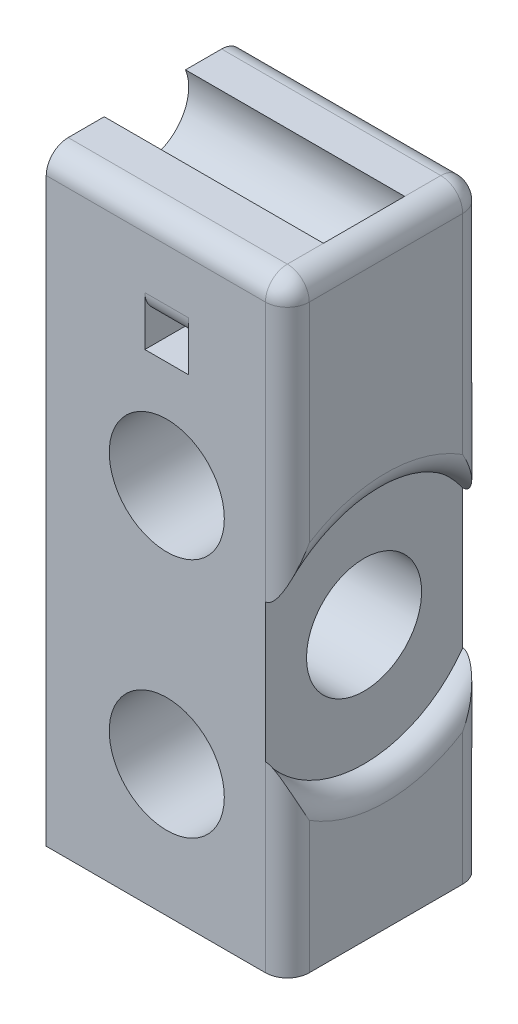
ISO-10303-21;
HEADER;
FILE_DESCRIPTION(('STEP AP214'),'2;1');
FILE_NAME('part.step','',(''),(''),'','','');
FILE_SCHEMA(('AUTOMOTIVE_DESIGN { 1 0 10303 214 1 1 1 1 }'));
ENDSEC;
DATA;
#1=APPLICATION_CONTEXT('core data for automotive mechanical design processes');
#2=APPLICATION_PROTOCOL_DEFINITION('international standard','automotive_design',2000,#1);
#3=PRODUCT_CONTEXT('',#1,'mechanical');
#4=PRODUCT('Part','Part','',(#3));
#5=PRODUCT_RELATED_PRODUCT_CATEGORY('part','',(#4));
#6=PRODUCT_DEFINITION_FORMATION('','',#4);
#7=PRODUCT_DEFINITION_CONTEXT('part definition',#1,'design');
#8=PRODUCT_DEFINITION('design','',#6,#7);
#9=PRODUCT_DEFINITION_SHAPE('','',#8);
#10=(LENGTH_UNIT() NAMED_UNIT(*) SI_UNIT(.MILLI.,.METRE.));
#11=(NAMED_UNIT(*) PLANE_ANGLE_UNIT() SI_UNIT($,.RADIAN.));
#12=(NAMED_UNIT(*) SI_UNIT($,.STERADIAN.) SOLID_ANGLE_UNIT());
#13=UNCERTAINTY_MEASURE_WITH_UNIT(LENGTH_MEASURE(1.E-05),#10,'distance_accuracy_value','');
#14=(GEOMETRIC_REPRESENTATION_CONTEXT(3) GLOBAL_UNCERTAINTY_ASSIGNED_CONTEXT((#13)) GLOBAL_UNIT_ASSIGNED_CONTEXT((#10,
#11,#12)) REPRESENTATION_CONTEXT('',''));
#15=CARTESIAN_POINT('',(0.,0.,0.));
#16=DIRECTION('',(0.,0.,1.));
#17=DIRECTION('',(1.,0.,0.));
#18=AXIS2_PLACEMENT_3D('',#15,#16,#17);
#19=CARTESIAN_POINT('',(0.,55.,-18.));
#20=DIRECTION('',(0.,1.,0.));
#21=DIRECTION('',(0.,0.,1.));
#22=AXIS2_PLACEMENT_3D('',#19,#20,#21);
#23=PLANE('',#22);
#24=DIRECTION('',(-1.,0.,0.));
#25=VECTOR('',#24,1.);
#26=CARTESIAN_POINT('',(22.,55.,-2.));
#27=LINE('',#26,#25);
#28=CARTESIAN_POINT('',(0.,55.,-2.));
#29=VERTEX_POINT('',#28);
#30=CARTESIAN_POINT('',(20.,55.,-2.));
#31=VERTEX_POINT('',#30);
#32=EDGE_CURVE('E189',#29,#31,#27,.F.);
#33=ORIENTED_EDGE('',*,*,#32,.T.);
#34=DIRECTION('',(0.,0.,1.));
#35=VECTOR('',#34,1.);
#36=CARTESIAN_POINT('',(20.,55.,-18.));
#37=LINE('',#36,#35);
#38=CARTESIAN_POINT('',(20.,55.,-5.29190075645216));
#39=VERTEX_POINT('',#38);
#40=EDGE_CURVE('E11',#31,#39,#37,.F.);
#41=ORIENTED_EDGE('',*,*,#40,.T.);
#42=DIRECTION('',(-1.,0.,0.));
#43=VECTOR('',#42,1.);
#44=CARTESIAN_POINT('',(20.,55.,-5.29190075645216));
#45=LINE('',#44,#43);
#46=CARTESIAN_POINT('',(0.,55.,-5.29190075645216));
#47=VERTEX_POINT('',#46);
#48=EDGE_CURVE('E290',#39,#47,#45,.T.);
#49=ORIENTED_EDGE('',*,*,#48,.T.);
#50=DIRECTION('',(0.,0.,1.));
#51=VECTOR('',#50,1.);
#52=CARTESIAN_POINT('',(0.,55.,-18.));
#53=LINE('',#52,#51);
#54=EDGE_CURVE('E286',#47,#29,#53,.T.);
#55=ORIENTED_EDGE('',*,*,#54,.T.);
#56=EDGE_LOOP('',(#33,#41,#49,#55));
#57=FACE_BOUND('',#56,.T.);
#58=ADVANCED_FACE('F37',(#57),#23,.T.);
#59=CARTESIAN_POINT('',(22.,55.,-18.));
#60=DIRECTION('',(1.,0.,0.));
#61=DIRECTION('',(0.,1.,0.));
#62=AXIS2_PLACEMENT_3D('',#59,#60,#61);
#63=PLANE('',#62);
#64=DIRECTION('',(0.,0.,1.));
#65=VECTOR('',#64,1.);
#66=CARTESIAN_POINT('',(22.,0.,-18.));
#67=LINE('',#66,#65);
#68=CARTESIAN_POINT('',(22.,0.,-16.));
#69=VERTEX_POINT('',#68);
#70=CARTESIAN_POINT('',(22.,0.,-2.));
#71=VERTEX_POINT('',#70);
#72=EDGE_CURVE('E277',#69,#71,#67,.T.);
#73=ORIENTED_EDGE('',*,*,#72,.F.);
#74=DIRECTION('',(0.,1.,0.));
#75=VECTOR('',#74,1.);
#76=CARTESIAN_POINT('',(22.,55.,-16.));
#77=LINE('',#76,#75);
#78=CARTESIAN_POINT('',(22.,12.0455488498967,-16.));
#79=VERTEX_POINT('',#78);
#80=EDGE_CURVE('E305',#69,#79,#77,.T.);
#81=ORIENTED_EDGE('',*,*,#80,.T.);
#82=CARTESIAN_POINT('',(22.,23.,-9.));
#83=DIRECTION('',(1.,0.,0.));
#84=DIRECTION('',(0.,1.,0.));
#85=AXIS2_PLACEMENT_3D('',#82,#83,#84);
#86=CIRCLE('',#85,13.);
#87=CARTESIAN_POINT('',(22.,12.0455488498967,-2.));
#88=VERTEX_POINT('',#87);
#89=EDGE_CURVE('E303',#79,#88,#86,.F.);
#90=ORIENTED_EDGE('',*,*,#89,.T.);
#91=DIRECTION('',(0.,1.,0.));
#92=VECTOR('',#91,1.);
#93=CARTESIAN_POINT('',(22.,0.,-2.));
#94=LINE('',#93,#92);
#95=EDGE_CURVE('E209',#88,#71,#94,.F.);
#96=ORIENTED_EDGE('',*,*,#95,.T.);
#97=EDGE_LOOP('',(#73,#81,#90,#96));
#98=FACE_BOUND('',#97,.T.);
#99=ADVANCED_FACE('F398',(#98),#63,.T.);
#100=CARTESIAN_POINT('',(22.,23.,-9.));
#101=DIRECTION('',(-1.,0.,0.));
#102=DIRECTION('',(0.,0.,1.));
#103=AXIS2_PLACEMENT_3D('',#100,#101,#102);
#104=CYLINDRICAL_SURFACE('',#103,5.25);
#105=CARTESIAN_POINT('',(0.,23.,-9.));
#106=DIRECTION('',(-1.,0.,0.));
#107=DIRECTION('',(0.,0.,1.));
#108=AXIS2_PLACEMENT_3D('',#105,#106,#107);
#109=CIRCLE('',#108,5.25);
#110=CARTESIAN_POINT('',(0.,23.,-3.75));
#111=VERTEX_POINT('',#110);
#112=EDGE_CURVE('E228',#111,#111,#109,.T.);
#113=ORIENTED_EDGE('',*,*,#112,.T.);
#114=EDGE_LOOP('',(#113));
#115=FACE_BOUND('',#114,.T.);
#116=CARTESIAN_POINT('',(20.,23.,-9.));
#117=DIRECTION('',(1.,0.,0.));
#118=DIRECTION('',(0.,1.,0.));
#119=AXIS2_PLACEMENT_3D('',#116,#117,#118);
#120=CIRCLE('',#119,5.25);
#121=CARTESIAN_POINT('',(20.,28.25,-9.));
#122=VERTEX_POINT('',#121);
#123=EDGE_CURVE('E203',#122,#122,#120,.F.);
#124=ORIENTED_EDGE('',*,*,#123,.F.);
#125=EDGE_LOOP('',(#124));
#126=FACE_BOUND('',#125,.T.);
#127=ADVANCED_FACE('F405',(#115,#126),#104,.F.);
#128=DIRECTION('',(-1.,0.,0.));
#129=VECTOR('',#128,1.);
#130=CARTESIAN_POINT('',(20.,55.,-12.7080992435478));
#131=LINE('',#130,#129);
#132=CARTESIAN_POINT('',(0.,55.,-12.7080992435478));
#133=VERTEX_POINT('',#132);
#134=CARTESIAN_POINT('',(20.,55.,-12.7080992435478));
#135=VERTEX_POINT('',#134);
#136=EDGE_CURVE('E293',#133,#135,#131,.F.);
#137=ORIENTED_EDGE('',*,*,#136,.T.);
#138=DIRECTION('',(0.,0.,1.));
#139=VECTOR('',#138,1.);
#140=CARTESIAN_POINT('',(20.,55.,-18.));
#141=LINE('',#140,#139);
#142=CARTESIAN_POINT('',(20.,55.,-16.));
#143=VERTEX_POINT('',#142);
#144=EDGE_CURVE('E46',#135,#143,#141,.F.);
#145=ORIENTED_EDGE('',*,*,#144,.T.);
#146=DIRECTION('',(-1.,0.,0.));
#147=VECTOR('',#146,1.);
#148=CARTESIAN_POINT('',(0.,55.,-16.));
#149=LINE('',#148,#147);
#150=CARTESIAN_POINT('',(0.,55.,-16.));
#151=VERTEX_POINT('',#150);
#152=EDGE_CURVE('E322',#143,#151,#149,.T.);
#153=ORIENTED_EDGE('',*,*,#152,.T.);
#154=EDGE_CURVE('E284',#151,#133,#53,.T.);
#155=ORIENTED_EDGE('',*,*,#154,.T.);
#156=EDGE_LOOP('',(#137,#145,#153,#155));
#157=FACE_BOUND('',#156,.T.);
#158=ADVANCED_FACE('F401',(#157),#23,.T.);
#159=CARTESIAN_POINT('',(22.,0.,-18.));
#160=DIRECTION('',(0.,-1.,0.));
#161=DIRECTION('',(1.,0.,0.));
#162=AXIS2_PLACEMENT_3D('',#159,#160,#161);
#163=PLANE('',#162);
#164=DIRECTION('',(1.,0.,0.));
#165=VECTOR('',#164,1.);
#166=CARTESIAN_POINT('',(22.,0.,-18.));
#167=LINE('',#166,#165);
#168=CARTESIAN_POINT('',(0.,0.,-18.));
#169=VERTEX_POINT('',#168);
#170=CARTESIAN_POINT('',(20.,0.,-18.));
#171=VERTEX_POINT('',#170);
#172=EDGE_CURVE('E271',#169,#171,#167,.T.);
#173=ORIENTED_EDGE('',*,*,#172,.T.);
#174=CARTESIAN_POINT('',(20.,0.,-16.));
#175=DIRECTION('',(0.,-1.,0.));
#176=DIRECTION('',(1.,0.,0.));
#177=AXIS2_PLACEMENT_3D('',#174,#175,#176);
#178=CIRCLE('',#177,2.);
#179=EDGE_CURVE('E316',#171,#69,#178,.T.);
#180=ORIENTED_EDGE('',*,*,#179,.T.);
#181=ORIENTED_EDGE('',*,*,#72,.T.);
#182=CARTESIAN_POINT('',(20.,0.,-2.));
#183=DIRECTION('',(0.,-1.,0.));
#184=DIRECTION('',(1.,0.,0.));
#185=AXIS2_PLACEMENT_3D('',#182,#183,#184);
#186=CIRCLE('',#185,2.);
#187=CARTESIAN_POINT('',(20.,0.,0.));
#188=VERTEX_POINT('',#187);
#189=EDGE_CURVE('E314',#71,#188,#186,.T.);
#190=ORIENTED_EDGE('',*,*,#189,.T.);
#191=DIRECTION('',(1.,0.,0.));
#192=VECTOR('',#191,1.);
#193=CARTESIAN_POINT('',(22.,0.,0.));
#194=LINE('',#193,#192);
#195=CARTESIAN_POINT('',(0.,0.,0.));
#196=VERTEX_POINT('',#195);
#197=EDGE_CURVE('E185',#196,#188,#194,.T.);
#198=ORIENTED_EDGE('',*,*,#197,.F.);
#199=DIRECTION('',(0.,0.,1.));
#200=VECTOR('',#199,1.);
#201=CARTESIAN_POINT('',(0.,0.,-18.));
#202=LINE('',#201,#200);
#203=EDGE_CURVE('E280',#169,#196,#202,.T.);
#204=ORIENTED_EDGE('',*,*,#203,.F.);
#205=EDGE_LOOP('',(#173,#180,#181,#190,#198,#204));
#206=FACE_BOUND('',#205,.T.);
#207=ADVANCED_FACE('F411',(#206),#163,.T.);
#208=CARTESIAN_POINT('',(0.,0.,-18.));
#209=DIRECTION('',(-1.,0.,0.));
#210=DIRECTION('',(0.,0.,1.));
#211=AXIS2_PLACEMENT_3D('',#208,#209,#210);
#212=PLANE('',#211);
#213=ORIENTED_EDGE('',*,*,#112,.F.);
#214=EDGE_LOOP('',(#213));
#215=FACE_BOUND('',#214,.T.);
#216=ORIENTED_EDGE('',*,*,#154,.F.);
#217=CARTESIAN_POINT('',(0.,53.,-16.));
#218=DIRECTION('',(-1.,0.,0.));
#219=DIRECTION('',(0.,0.,1.));
#220=AXIS2_PLACEMENT_3D('',#217,#218,#219);
#221=CIRCLE('',#220,2.);
#222=CARTESIAN_POINT('',(0.,53.,-18.));
#223=VERTEX_POINT('',#222);
#224=EDGE_CURVE('E326',#151,#223,#221,.T.);
#225=ORIENTED_EDGE('',*,*,#224,.T.);
#226=DIRECTION('',(0.,-1.,0.));
#227=VECTOR('',#226,1.);
#228=CARTESIAN_POINT('',(0.,0.,-18.));
#229=LINE('',#228,#227);
#230=EDGE_CURVE('E274',#223,#169,#229,.T.);
#231=ORIENTED_EDGE('',*,*,#230,.T.);
#232=ORIENTED_EDGE('',*,*,#203,.T.);
#233=DIRECTION('',(0.,-1.,0.));
#234=VECTOR('',#233,1.);
#235=CARTESIAN_POINT('',(0.,0.,0.));
#236=LINE('',#235,#234);
#237=CARTESIAN_POINT('',(0.,53.,0.));
#238=VERTEX_POINT('',#237);
#239=EDGE_CURVE('E275',#238,#196,#236,.T.);
#240=ORIENTED_EDGE('',*,*,#239,.F.);
#241=CARTESIAN_POINT('',(0.,53.,-2.));
#242=DIRECTION('',(-1.,0.,0.));
#243=DIRECTION('',(0.,0.,1.));
#244=AXIS2_PLACEMENT_3D('',#241,#242,#243);
#245=CIRCLE('',#244,2.);
#246=EDGE_CURVE('E324',#238,#29,#245,.T.);
#247=ORIENTED_EDGE('',*,*,#246,.T.);
#248=ORIENTED_EDGE('',*,*,#54,.F.);
#249=CARTESIAN_POINT('',(0.,53.5,-9.));
#250=DIRECTION('',(1.,0.,0.));
#251=DIRECTION('',(0.,0.,-1.));
#252=AXIS2_PLACEMENT_3D('',#249,#250,#251);
#253=CIRCLE('',#252,4.00000000000001);
#254=EDGE_CURVE('E224',#47,#133,#253,.T.);
#255=ORIENTED_EDGE('',*,*,#254,.T.);
#256=EDGE_LOOP('',(#216,#225,#231,#232,#240,#247,#248,#255));
#257=FACE_BOUND('',#256,.T.);
#258=ADVANCED_FACE('F417',(#215,#257),#212,.T.);
#259=DIRECTION('',(0.,1.,0.));
#260=VECTOR('',#259,1.);
#261=CARTESIAN_POINT('',(22.,55.,-16.));
#262=LINE('',#261,#260);
#263=CARTESIAN_POINT('',(22.,33.9544511501033,-16.));
#264=VERTEX_POINT('',#263);
#265=CARTESIAN_POINT('',(22.,53.,-16.));
#266=VERTEX_POINT('',#265);
#267=EDGE_CURVE('E300',#264,#266,#262,.T.);
#268=ORIENTED_EDGE('',*,*,#267,.T.);
#269=DIRECTION('',(0.,0.,1.));
#270=VECTOR('',#269,1.);
#271=CARTESIAN_POINT('',(22.,53.,-18.));
#272=LINE('',#271,#270);
#273=CARTESIAN_POINT('',(22.,53.,-2.));
#274=VERTEX_POINT('',#273);
#275=EDGE_CURVE('E62',#266,#274,#272,.T.);
#276=ORIENTED_EDGE('',*,*,#275,.T.);
#277=DIRECTION('',(0.,1.,0.));
#278=VECTOR('',#277,1.);
#279=CARTESIAN_POINT('',(22.,29.3245553203368,-2.));
#280=LINE('',#279,#278);
#281=CARTESIAN_POINT('',(22.,33.9544511501033,-2.));
#282=VERTEX_POINT('',#281);
#283=EDGE_CURVE('E295',#274,#282,#280,.F.);
#284=ORIENTED_EDGE('',*,*,#283,.T.);
#285=CARTESIAN_POINT('',(22.,23.,-9.));
#286=DIRECTION('',(1.,0.,0.));
#287=DIRECTION('',(0.,1.,0.));
#288=AXIS2_PLACEMENT_3D('',#285,#286,#287);
#289=CIRCLE('',#288,13.);
#290=EDGE_CURVE('E298',#282,#264,#289,.F.);
#291=ORIENTED_EDGE('',*,*,#290,.T.);
#292=EDGE_LOOP('',(#268,#276,#284,#291));
#293=FACE_BOUND('',#292,.T.);
#294=ADVANCED_FACE('F408',(#293),#63,.T.);
#295=CARTESIAN_POINT('',(0.,0.,-18.));
#296=DIRECTION('',(0.,0.,-1.));
#297=DIRECTION('',(-1.,0.,0.));
#298=AXIS2_PLACEMENT_3D('',#295,#296,#297);
#299=PLANE('',#298);
#300=DIRECTION('',(0.,-1.,0.));
#301=VECTOR('',#300,1.);
#302=CARTESIAN_POINT('',(20.,0.,-18.));
#303=LINE('',#302,#301);
#304=CARTESIAN_POINT('',(20.,29.3245553203368,-18.));
#305=VERTEX_POINT('',#304);
#306=CARTESIAN_POINT('',(20.,16.6754446796632,-18.));
#307=VERTEX_POINT('',#306);
#308=EDGE_CURVE('E202',#305,#307,#303,.T.);
#309=ORIENTED_EDGE('',*,*,#308,.T.);
#310=DIRECTION('',(0.,1.,0.));
#311=VECTOR('',#310,1.);
#312=CARTESIAN_POINT('',(20.,0.,-18.));
#313=LINE('',#312,#311);
#314=EDGE_CURVE('E312',#307,#171,#313,.F.);
#315=ORIENTED_EDGE('',*,*,#314,.T.);
#316=ORIENTED_EDGE('',*,*,#172,.F.);
#317=ORIENTED_EDGE('',*,*,#230,.F.);
#318=DIRECTION('',(-1.,0.,0.));
#319=VECTOR('',#318,1.);
#320=CARTESIAN_POINT('',(0.,53.,-18.));
#321=LINE('',#320,#319);
#322=CARTESIAN_POINT('',(20.,53.,-18.));
#323=VERTEX_POINT('',#322);
#324=EDGE_CURVE('E307',#223,#323,#321,.F.);
#325=ORIENTED_EDGE('',*,*,#324,.T.);
#326=DIRECTION('',(0.,1.,0.));
#327=VECTOR('',#326,1.);
#328=CARTESIAN_POINT('',(20.,0.,-18.));
#329=LINE('',#328,#327);
#330=EDGE_CURVE('E310',#323,#305,#329,.F.);
#331=ORIENTED_EDGE('',*,*,#330,.T.);
#332=EDGE_LOOP('',(#309,#315,#316,#317,#325,#331));
#333=FACE_BOUND('',#332,.T.);
#334=DIRECTION('',(-1.,0.,0.));
#335=VECTOR('',#334,1.);
#336=CARTESIAN_POINT('',(9.,48.25,-18.));
#337=LINE('',#336,#335);
#338=CARTESIAN_POINT('',(13.,48.25,-18.));
#339=VERTEX_POINT('',#338);
#340=CARTESIAN_POINT('',(9.,48.25,-18.));
#341=VERTEX_POINT('',#340);
#342=EDGE_CURVE('E328',#339,#341,#337,.T.);
#343=ORIENTED_EDGE('',*,*,#342,.T.);
#344=DIRECTION('',(0.,-1.,0.));
#345=VECTOR('',#344,1.);
#346=CARTESIAN_POINT('',(9.,43.75,-18.));
#347=LINE('',#346,#345);
#348=CARTESIAN_POINT('',(9.,43.75,-18.));
#349=VERTEX_POINT('',#348);
#350=EDGE_CURVE('E234',#341,#349,#347,.T.);
#351=ORIENTED_EDGE('',*,*,#350,.T.);
#352=DIRECTION('',(1.,0.,0.));
#353=VECTOR('',#352,1.);
#354=CARTESIAN_POINT('',(13.,43.75,-18.));
#355=LINE('',#354,#353);
#356=CARTESIAN_POINT('',(13.,43.75,-18.));
#357=VERTEX_POINT('',#356);
#358=EDGE_CURVE('E237',#349,#357,#355,.T.);
#359=ORIENTED_EDGE('',*,*,#358,.T.);
#360=DIRECTION('',(0.,1.,0.));
#361=VECTOR('',#360,1.);
#362=CARTESIAN_POINT('',(13.,43.75,-18.));
#363=LINE('',#362,#361);
#364=EDGE_CURVE('E241',#357,#339,#363,.T.);
#365=ORIENTED_EDGE('',*,*,#364,.T.);
#366=EDGE_LOOP('',(#343,#351,#359,#365));
#367=FACE_BOUND('',#366,.T.);
#368=CARTESIAN_POINT('',(11.,34.,-18.));
#369=DIRECTION('',(0.,0.,1.));
#370=DIRECTION('',(1.,0.,0.));
#371=AXIS2_PLACEMENT_3D('',#368,#369,#370);
#372=CIRCLE('',#371,5.25);
#373=CARTESIAN_POINT('',(16.25,34.,-18.));
#374=VERTEX_POINT('',#373);
#375=EDGE_CURVE('E260',#374,#374,#372,.T.);
#376=ORIENTED_EDGE('',*,*,#375,.T.);
#377=EDGE_LOOP('',(#376));
#378=FACE_BOUND('',#377,.T.);
#379=CARTESIAN_POINT('',(11.,12.,-18.));
#380=DIRECTION('',(0.,0.,1.));
#381=DIRECTION('',(1.,0.,0.));
#382=AXIS2_PLACEMENT_3D('',#379,#380,#381);
#383=CIRCLE('',#382,5.25);
#384=CARTESIAN_POINT('',(16.25,12.,-18.));
#385=VERTEX_POINT('',#384);
#386=EDGE_CURVE('E266',#385,#385,#383,.T.);
#387=ORIENTED_EDGE('',*,*,#386,.T.);
#388=EDGE_LOOP('',(#387));
#389=FACE_BOUND('',#388,.T.);
#390=ADVANCED_FACE('F469',(#333,#367,#378,#389),#299,.T.);
#391=CARTESIAN_POINT('',(0.,0.,0.));
#392=DIRECTION('',(0.,0.,-1.));
#393=DIRECTION('',(-1.,0.,0.));
#394=AXIS2_PLACEMENT_3D('',#391,#392,#393);
#395=PLANE('',#394);
#396=DIRECTION('',(0.,-1.,0.));
#397=VECTOR('',#396,1.);
#398=CARTESIAN_POINT('',(9.,43.75,0.));
#399=LINE('',#398,#397);
#400=CARTESIAN_POINT('',(9.,48.25,0.));
#401=VERTEX_POINT('',#400);
#402=CARTESIAN_POINT('',(9.,43.75,0.));
#403=VERTEX_POINT('',#402);
#404=EDGE_CURVE('E233',#401,#403,#399,.T.);
#405=ORIENTED_EDGE('',*,*,#404,.F.);
#406=DIRECTION('',(-1.,0.,0.));
#407=VECTOR('',#406,1.);
#408=CARTESIAN_POINT('',(0.,48.25,0.));
#409=LINE('',#408,#407);
#410=CARTESIAN_POINT('',(13.,48.25,0.));
#411=VERTEX_POINT('',#410);
#412=EDGE_CURVE('E457',#401,#411,#409,.F.);
#413=ORIENTED_EDGE('',*,*,#412,.T.);
#414=DIRECTION('',(0.,1.,0.));
#415=VECTOR('',#414,1.);
#416=CARTESIAN_POINT('',(13.,43.75,0.));
#417=LINE('',#416,#415);
#418=CARTESIAN_POINT('',(13.,43.75,0.));
#419=VERTEX_POINT('',#418);
#420=EDGE_CURVE('E238',#419,#411,#417,.T.);
#421=ORIENTED_EDGE('',*,*,#420,.F.);
#422=DIRECTION('',(1.,0.,0.));
#423=VECTOR('',#422,1.);
#424=CARTESIAN_POINT('',(13.,43.75,0.));
#425=LINE('',#424,#423);
#426=EDGE_CURVE('E245',#403,#419,#425,.T.);
#427=ORIENTED_EDGE('',*,*,#426,.F.);
#428=EDGE_LOOP('',(#405,#413,#421,#427));
#429=FACE_BOUND('',#428,.T.);
#430=CARTESIAN_POINT('',(11.,34.,0.));
#431=DIRECTION('',(0.,0.,1.));
#432=DIRECTION('',(1.,0.,0.));
#433=AXIS2_PLACEMENT_3D('',#430,#431,#432);
#434=CIRCLE('',#433,5.25);
#435=CARTESIAN_POINT('',(16.25,34.,0.));
#436=VERTEX_POINT('',#435);
#437=EDGE_CURVE('E252',#436,#436,#434,.T.);
#438=ORIENTED_EDGE('',*,*,#437,.F.);
#439=EDGE_LOOP('',(#438));
#440=FACE_BOUND('',#439,.T.);
#441=CARTESIAN_POINT('',(11.,12.,0.));
#442=DIRECTION('',(0.,0.,1.));
#443=DIRECTION('',(1.,0.,0.));
#444=AXIS2_PLACEMENT_3D('',#441,#442,#443);
#445=CIRCLE('',#444,5.25);
#446=CARTESIAN_POINT('',(16.25,12.,0.));
#447=VERTEX_POINT('',#446);
#448=EDGE_CURVE('E263',#447,#447,#445,.T.);
#449=ORIENTED_EDGE('',*,*,#448,.F.);
#450=EDGE_LOOP('',(#449));
#451=FACE_BOUND('',#450,.T.);
#452=ORIENTED_EDGE('',*,*,#197,.T.);
#453=DIRECTION('',(0.,1.,0.));
#454=VECTOR('',#453,1.);
#455=CARTESIAN_POINT('',(20.,16.6754446796632,0.));
#456=LINE('',#455,#454);
#457=CARTESIAN_POINT('',(20.,16.6754446796632,0.));
#458=VERTEX_POINT('',#457);
#459=EDGE_CURVE('E179',#188,#458,#456,.T.);
#460=ORIENTED_EDGE('',*,*,#459,.T.);
#461=DIRECTION('',(0.,-1.,0.));
#462=VECTOR('',#461,1.);
#463=CARTESIAN_POINT('',(20.,0.,0.));
#464=LINE('',#463,#462);
#465=CARTESIAN_POINT('',(20.,29.3245553203368,0.));
#466=VERTEX_POINT('',#465);
#467=EDGE_CURVE('E183',#466,#458,#464,.T.);
#468=ORIENTED_EDGE('',*,*,#467,.F.);
#469=DIRECTION('',(0.,1.,0.));
#470=VECTOR('',#469,1.);
#471=CARTESIAN_POINT('',(20.,55.,0.));
#472=LINE('',#471,#470);
#473=CARTESIAN_POINT('',(20.,53.,0.));
#474=VERTEX_POINT('',#473);
#475=EDGE_CURVE('E190',#466,#474,#472,.T.);
#476=ORIENTED_EDGE('',*,*,#475,.T.);
#477=DIRECTION('',(-1.,0.,0.));
#478=VECTOR('',#477,1.);
#479=CARTESIAN_POINT('',(0.,53.,0.));
#480=LINE('',#479,#478);
#481=EDGE_CURVE('E318',#474,#238,#480,.T.);
#482=ORIENTED_EDGE('',*,*,#481,.T.);
#483=ORIENTED_EDGE('',*,*,#239,.T.);
#484=EDGE_LOOP('',(#452,#460,#468,#476,#482,#483));
#485=FACE_BOUND('',#484,.T.);
#486=ADVANCED_FACE('F181',(#429,#440,#451,#485),#395,.F.);
#487=CARTESIAN_POINT('',(11.,12.,-18.));
#488=DIRECTION('',(0.,0.,1.));
#489=DIRECTION('',(1.,0.,0.));
#490=AXIS2_PLACEMENT_3D('',#487,#488,#489);
#491=CYLINDRICAL_SURFACE('',#490,5.25);
#492=ORIENTED_EDGE('',*,*,#386,.F.);
#493=EDGE_LOOP('',(#492));
#494=FACE_BOUND('',#493,.T.);
#495=ORIENTED_EDGE('',*,*,#448,.T.);
#496=EDGE_LOOP('',(#495));
#497=FACE_BOUND('',#496,.T.);
#498=ADVANCED_FACE('F491',(#494,#497),#491,.F.);
#499=CARTESIAN_POINT('',(11.,34.,-18.));
#500=DIRECTION('',(0.,0.,1.));
#501=DIRECTION('',(1.,0.,0.));
#502=AXIS2_PLACEMENT_3D('',#499,#500,#501);
#503=CYLINDRICAL_SURFACE('',#502,5.25);
#504=ORIENTED_EDGE('',*,*,#375,.F.);
#505=EDGE_LOOP('',(#504));
#506=FACE_BOUND('',#505,.T.);
#507=ORIENTED_EDGE('',*,*,#437,.T.);
#508=EDGE_LOOP('',(#507));
#509=FACE_BOUND('',#508,.T.);
#510=ADVANCED_FACE('F498',(#506,#509),#503,.F.);
#511=CARTESIAN_POINT('',(9.,43.75,-18.));
#512=DIRECTION('',(-1.,0.,0.));
#513=DIRECTION('',(0.,0.,1.));
#514=AXIS2_PLACEMENT_3D('',#511,#512,#513);
#515=PLANE('',#514);
#516=ORIENTED_EDGE('',*,*,#404,.T.);
#517=DIRECTION('',(0.,0.,1.));
#518=VECTOR('',#517,1.);
#519=CARTESIAN_POINT('',(9.,43.75,-18.));
#520=LINE('',#519,#518);
#521=EDGE_CURVE('E243',#349,#403,#520,.T.);
#522=ORIENTED_EDGE('',*,*,#521,.F.);
#523=ORIENTED_EDGE('',*,*,#350,.F.);
#524=CARTESIAN_POINT('',(9.,48.25,-16.));
#525=DIRECTION('',(-1.,0.,0.));
#526=DIRECTION('',(0.,0.,1.));
#527=AXIS2_PLACEMENT_3D('',#524,#525,#526);
#528=CIRCLE('',#527,2.);
#529=CARTESIAN_POINT('',(9.,46.25,-16.));
#530=VERTEX_POINT('',#529);
#531=EDGE_CURVE('E455',#341,#530,#528,.T.);
#532=ORIENTED_EDGE('',*,*,#531,.T.);
#533=DIRECTION('',(0.,0.,1.));
#534=VECTOR('',#533,1.);
#535=CARTESIAN_POINT('',(9.,46.25,-18.));
#536=LINE('',#535,#534);
#537=CARTESIAN_POINT('',(9.,46.25,-2.));
#538=VERTEX_POINT('',#537);
#539=EDGE_CURVE('E249',#530,#538,#536,.T.);
#540=ORIENTED_EDGE('',*,*,#539,.T.);
#541=CARTESIAN_POINT('',(9.,48.25,-2.));
#542=DIRECTION('',(-1.,0.,0.));
#543=DIRECTION('',(0.,0.,1.));
#544=AXIS2_PLACEMENT_3D('',#541,#542,#543);
#545=CIRCLE('',#544,2.);
#546=EDGE_CURVE('E449',#538,#401,#545,.T.);
#547=ORIENTED_EDGE('',*,*,#546,.T.);
#548=EDGE_LOOP('',(#516,#522,#523,#532,#540,#547));
#549=FACE_BOUND('',#548,.T.);
#550=ADVANCED_FACE('F475',(#549),#515,.F.);
#551=CARTESIAN_POINT('',(13.,46.25,-18.));
#552=DIRECTION('',(0.,1.,0.));
#553=DIRECTION('',(0.,0.,1.));
#554=AXIS2_PLACEMENT_3D('',#551,#552,#553);
#555=PLANE('',#554);
#556=ORIENTED_EDGE('',*,*,#539,.F.);
#557=DIRECTION('',(-1.,0.,0.));
#558=VECTOR('',#557,1.);
#559=CARTESIAN_POINT('',(13.,46.25,-16.));
#560=LINE('',#559,#558);
#561=CARTESIAN_POINT('',(13.,46.25,-16.));
#562=VERTEX_POINT('',#561);
#563=EDGE_CURVE('E460',#530,#562,#560,.F.);
#564=ORIENTED_EDGE('',*,*,#563,.T.);
#565=DIRECTION('',(0.,0.,1.));
#566=VECTOR('',#565,1.);
#567=CARTESIAN_POINT('',(13.,46.25,-18.));
#568=LINE('',#567,#566);
#569=CARTESIAN_POINT('',(13.,46.25,-2.));
#570=VERTEX_POINT('',#569);
#571=EDGE_CURVE('E253',#562,#570,#568,.T.);
#572=ORIENTED_EDGE('',*,*,#571,.T.);
#573=DIRECTION('',(-1.,0.,0.));
#574=VECTOR('',#573,1.);
#575=CARTESIAN_POINT('',(13.,46.25,-2.));
#576=LINE('',#575,#574);
#577=EDGE_CURVE('E461',#570,#538,#576,.T.);
#578=ORIENTED_EDGE('',*,*,#577,.T.);
#579=EDGE_LOOP('',(#556,#564,#572,#578));
#580=FACE_BOUND('',#579,.T.);
#581=ADVANCED_FACE('F476',(#580),#555,.F.);
#582=CARTESIAN_POINT('',(13.,43.75,-18.));
#583=DIRECTION('',(1.,0.,0.));
#584=DIRECTION('',(0.,0.,-1.));
#585=AXIS2_PLACEMENT_3D('',#582,#583,#584);
#586=PLANE('',#585);
#587=ORIENTED_EDGE('',*,*,#420,.T.);
#588=CARTESIAN_POINT('',(13.,48.25,-2.));
#589=DIRECTION('',(1.,0.,0.));
#590=DIRECTION('',(0.,0.,-1.));
#591=AXIS2_PLACEMENT_3D('',#588,#589,#590);
#592=CIRCLE('',#591,2.);
#593=EDGE_CURVE('E447',#411,#570,#592,.T.);
#594=ORIENTED_EDGE('',*,*,#593,.T.);
#595=ORIENTED_EDGE('',*,*,#571,.F.);
#596=CARTESIAN_POINT('',(13.,48.25,-16.));
#597=DIRECTION('',(1.,0.,0.));
#598=DIRECTION('',(0.,0.,-1.));
#599=AXIS2_PLACEMENT_3D('',#596,#597,#598);
#600=CIRCLE('',#599,2.);
#601=EDGE_CURVE('E452',#562,#339,#600,.T.);
#602=ORIENTED_EDGE('',*,*,#601,.T.);
#603=ORIENTED_EDGE('',*,*,#364,.F.);
#604=DIRECTION('',(0.,0.,1.));
#605=VECTOR('',#604,1.);
#606=CARTESIAN_POINT('',(13.,43.75,-18.));
#607=LINE('',#606,#605);
#608=EDGE_CURVE('E256',#357,#419,#607,.T.);
#609=ORIENTED_EDGE('',*,*,#608,.T.);
#610=EDGE_LOOP('',(#587,#594,#595,#602,#603,#609));
#611=FACE_BOUND('',#610,.T.);
#612=ADVANCED_FACE('F479',(#611),#586,.F.);
#613=CARTESIAN_POINT('',(13.,43.75,-18.));
#614=DIRECTION('',(0.,-1.,0.));
#615=DIRECTION('',(0.,0.,-1.));
#616=AXIS2_PLACEMENT_3D('',#613,#614,#615);
#617=PLANE('',#616);
#618=ORIENTED_EDGE('',*,*,#426,.T.);
#619=ORIENTED_EDGE('',*,*,#608,.F.);
#620=ORIENTED_EDGE('',*,*,#358,.F.);
#621=ORIENTED_EDGE('',*,*,#521,.T.);
#622=EDGE_LOOP('',(#618,#619,#620,#621));
#623=FACE_BOUND('',#622,.T.);
#624=ADVANCED_FACE('F487',(#623),#617,.F.);
#625=CARTESIAN_POINT('',(20.,53.5,-9.));
#626=DIRECTION('',(-1.,0.,0.));
#627=DIRECTION('',(0.,0.,1.));
#628=AXIS2_PLACEMENT_3D('',#625,#626,#627);
#629=CYLINDRICAL_SURFACE('',#628,4.00000000000001);
#630=ORIENTED_EDGE('',*,*,#254,.F.);
#631=ORIENTED_EDGE('',*,*,#48,.F.);
#632=CARTESIAN_POINT('',(20.,53.5,-9.));
#633=DIRECTION('',(1.,0.,0.));
#634=DIRECTION('',(0.,0.,-1.));
#635=AXIS2_PLACEMENT_3D('',#632,#633,#634);
#636=CIRCLE('',#635,4.00000000000001);
#637=EDGE_CURVE('E225',#39,#135,#636,.T.);
#638=ORIENTED_EDGE('',*,*,#637,.T.);
#639=ORIENTED_EDGE('',*,*,#136,.F.);
#640=EDGE_LOOP('',(#630,#631,#638,#639));
#641=FACE_BOUND('',#640,.T.);
#642=ADVANCED_FACE('F534',(#641),#629,.F.);
#643=CARTESIAN_POINT('',(20.,53.5,-9.));
#644=DIRECTION('',(1.,0.,0.));
#645=DIRECTION('',(0.,0.,-1.));
#646=AXIS2_PLACEMENT_3D('',#643,#644,#645);
#647=PLANE('',#646);
#648=DIRECTION('',(0.,0.,-1.));
#649=VECTOR('',#648,1.);
#650=CARTESIAN_POINT('',(20.,55.,-18.));
#651=LINE('',#650,#649);
#652=EDGE_CURVE('E283',#39,#135,#651,.T.);
#653=ORIENTED_EDGE('',*,*,#652,.T.);
#654=ORIENTED_EDGE('',*,*,#637,.F.);
#655=EDGE_LOOP('',(#653,#654));
#656=FACE_BOUND('',#655,.T.);
#657=ADVANCED_FACE('F536',(#656),#647,.F.);
#658=CARTESIAN_POINT('',(20.,23.,-9.));
#659=DIRECTION('',(1.,0.,0.));
#660=DIRECTION('',(0.,1.,0.));
#661=AXIS2_PLACEMENT_3D('',#658,#659,#660);
#662=PLANE('',#661);
#663=ORIENTED_EDGE('',*,*,#123,.T.);
#664=EDGE_LOOP('',(#663));
#665=FACE_BOUND('',#664,.T.);
#666=CARTESIAN_POINT('',(20.,23.,-9.));
#667=DIRECTION('',(1.,0.,0.));
#668=DIRECTION('',(0.,1.,0.));
#669=AXIS2_PLACEMENT_3D('',#666,#667,#668);
#670=CIRCLE('',#669,11.);
#671=EDGE_CURVE('E201',#305,#466,#670,.T.);
#672=ORIENTED_EDGE('',*,*,#671,.T.);
#673=ORIENTED_EDGE('',*,*,#467,.T.);
#674=EDGE_CURVE('E198',#458,#307,#670,.T.);
#675=ORIENTED_EDGE('',*,*,#674,.T.);
#676=ORIENTED_EDGE('',*,*,#308,.F.);
#677=EDGE_LOOP('',(#672,#673,#675,#676));
#678=FACE_BOUND('',#677,.T.);
#679=ADVANCED_FACE('F195',(#665,#678),#662,.T.);
#680=CARTESIAN_POINT('',(0.,53.,-16.));
#681=DIRECTION('',(-1.,0.,0.));
#682=DIRECTION('',(0.,0.,1.));
#683=AXIS2_PLACEMENT_3D('',#680,#681,#682);
#684=CYLINDRICAL_SURFACE('',#683,2.);
#685=ORIENTED_EDGE('',*,*,#152,.F.);
#686=CARTESIAN_POINT('',(20.,53.,-16.));
#687=DIRECTION('',(-1.,0.,0.));
#688=DIRECTION('',(0.,0.,1.));
#689=AXIS2_PLACEMENT_3D('',#686,#687,#688);
#690=CIRCLE('',#689,2.);
#691=EDGE_CURVE('E441',#143,#323,#690,.T.);
#692=ORIENTED_EDGE('',*,*,#691,.T.);
#693=ORIENTED_EDGE('',*,*,#324,.F.);
#694=ORIENTED_EDGE('',*,*,#224,.F.);
#695=EDGE_LOOP('',(#685,#692,#693,#694));
#696=FACE_BOUND('',#695,.T.);
#697=ADVANCED_FACE('F356',(#696),#684,.T.);
#698=CARTESIAN_POINT('',(0.,53.,-2.));
#699=DIRECTION('',(1.,0.,0.));
#700=DIRECTION('',(0.,0.,-1.));
#701=AXIS2_PLACEMENT_3D('',#698,#699,#700);
#702=CYLINDRICAL_SURFACE('',#701,2.);
#703=ORIENTED_EDGE('',*,*,#481,.F.);
#704=CARTESIAN_POINT('',(20.,53.,-2.));
#705=DIRECTION('',(1.,0.,0.));
#706=DIRECTION('',(0.,0.,-1.));
#707=AXIS2_PLACEMENT_3D('',#704,#705,#706);
#708=CIRCLE('',#707,2.);
#709=EDGE_CURVE('E54',#474,#31,#708,.F.);
#710=ORIENTED_EDGE('',*,*,#709,.T.);
#711=ORIENTED_EDGE('',*,*,#32,.F.);
#712=ORIENTED_EDGE('',*,*,#246,.F.);
#713=EDGE_LOOP('',(#703,#710,#711,#712));
#714=FACE_BOUND('',#713,.T.);
#715=ADVANCED_FACE('F352',(#714),#702,.T.);
#716=CARTESIAN_POINT('',(20.,55.,-16.));
#717=DIRECTION('',(0.,1.,0.));
#718=DIRECTION('',(-1.,0.,0.));
#719=AXIS2_PLACEMENT_3D('',#716,#717,#718);
#720=CYLINDRICAL_SURFACE('',#719,2.);
#721=ORIENTED_EDGE('',*,*,#330,.F.);
#722=CARTESIAN_POINT('',(20.,53.,-16.));
#723=DIRECTION('',(0.,1.,0.));
#724=DIRECTION('',(-1.,0.,0.));
#725=AXIS2_PLACEMENT_3D('',#722,#723,#724);
#726=CIRCLE('',#725,2.);
#727=EDGE_CURVE('E443',#323,#266,#726,.F.);
#728=ORIENTED_EDGE('',*,*,#727,.T.);
#729=ORIENTED_EDGE('',*,*,#267,.F.);
#730=CARTESIAN_POINT('',(20.,29.3245553203368,-18.));
#731=CARTESIAN_POINT('',(20.020357307062,29.3245457844284,-18.0000027705401));
#732=CARTESIAN_POINT('',(20.0407000112907,29.3255389676672,-17.9996889589179));
#733=CARTESIAN_POINT('',(20.081146856166,29.3294403273455,-17.9984547791985));
#734=CARTESIAN_POINT('',(20.1012513581021,29.3323450792356,-17.9975354957932));
#735=CARTESIAN_POINT('',(20.1603493985291,29.34367159753,-17.9939472041958));
#736=CARTESIAN_POINT('',(20.1988063965801,29.3547121015647,-17.9904458278124));
#737=CARTESIAN_POINT('',(20.2835509032194,29.3863278066289,-17.9803780899969));
#738=CARTESIAN_POINT('',(20.3290782015473,29.4086914829546,-17.9732331979057));
#739=CARTESIAN_POINT('',(20.4161215072044,29.4599628283248,-17.9567385048828));
#740=CARTESIAN_POINT('',(20.4576070893312,29.4889153640278,-17.9473735674867));
#741=CARTESIAN_POINT('',(20.5336622915172,29.5487889762802,-17.9278548156886));
#742=CARTESIAN_POINT('',(20.5685180129353,29.5793920613108,-17.9178154481326));
#743=CARTESIAN_POINT('',(20.6354010135162,29.6432487719655,-17.89670666947));
#744=CARTESIAN_POINT('',(20.6674256421591,29.6765048270887,-17.8856363126291));
#745=CARTESIAN_POINT('',(20.7290783304027,29.7449610539299,-17.8626668574808));
#746=CARTESIAN_POINT('',(20.7587032191845,29.7801636976639,-17.8507667001449));
#747=CARTESIAN_POINT('',(20.8158530708607,29.8519739014473,-17.8262936058946));
#748=CARTESIAN_POINT('',(20.8433788141139,29.888580931733,-17.8137209219788));
#749=CARTESIAN_POINT('',(20.9107540667192,29.9825696111064,-17.7811736531557));
#750=CARTESIAN_POINT('',(20.9494012451539,30.0406768119017,-17.7608084117069));
#751=CARTESIAN_POINT('',(21.0232633967308,30.1586456007142,-17.7189321263822));
#752=CARTESIAN_POINT('',(21.0584766920322,30.2185080279622,-17.6974205302422));
#753=CARTESIAN_POINT('',(21.159899856236,30.4001406456393,-17.6313138314847));
#754=CARTESIAN_POINT('',(21.2217754780234,30.523783769215,-17.5852062836471));
#755=CARTESIAN_POINT('',(21.3369263559222,30.7743719138066,-17.4893741357358));
#756=CARTESIAN_POINT('',(21.3901576823807,30.9013302139145,-17.4396328153178));
#757=CARTESIAN_POINT('',(21.4890560001807,31.1567846739443,-17.3370790130128));
#758=CARTESIAN_POINT('',(21.5347295298713,31.2852794003821,-17.2842692397));
#759=CARTESIAN_POINT('',(21.6115530499819,31.5194166973203,-17.1857651644888));
#760=CARTESIAN_POINT('',(21.6438276328039,31.6248987381048,-17.1405571059154));
#761=CARTESIAN_POINT('',(21.7041494533467,31.8362659464376,-17.0482894923875));
#762=CARTESIAN_POINT('',(21.7321963018254,31.9421511501855,-17.0012297674549));
#763=CARTESIAN_POINT('',(21.8102369161872,32.2602665949467,-16.8573102935896));
#764=CARTESIAN_POINT('',(21.8540888367299,32.4728272336213,-16.7577646625343));
#765=CARTESIAN_POINT('',(21.9251918696727,32.8965138167326,-16.5525931854501));
#766=CARTESIAN_POINT('',(21.9525184069059,33.1076418633326,-16.446997410054));
#767=CARTESIAN_POINT('',(21.9897783209841,33.5282956957848,-16.2299786052608));
#768=CARTESIAN_POINT('',(21.9997286006791,33.7378228411112,-16.1185613475531));
#769=CARTESIAN_POINT('',(21.9999981671707,33.9487537487154,-16.0031199883168));
#770=CARTESIAN_POINT('',(21.9999999926868,33.9516025858544,-16.0015602245695));
#771=CARTESIAN_POINT('',(22.,33.9544511501033,-16.));
#772=B_SPLINE_CURVE_WITH_KNOTS('',3,(#730,#731,#732,#733,#734,#735,#736,#737,#738,#739,#740,
#741,#742,#743,#744,#745,#746,#747,#748,#749,#750,#751,#752,#753,#754,#755,#756,#757,#758,#759,
#760,#761,#762,#763,#764,#765,#766,#767,#768,#769,#770,#771),.UNSPECIFIED.,.F.,.F.,(4,2,2,2,2,2,
2,2,2,2,2,2,2,2,2,2,2,2,2,2,4),(0.,0.0610192699636382,0.121929521236596,0.241748332477388,
0.394564846705972,0.548454866797625,0.690621420896311,0.832919694661286,0.97540302261021,
1.11783312143296,1.33576761250294,1.55380806124227,1.99053713100286,2.42942050642865,
2.86792219027437,3.22547107155138,3.58305285181873,4.29865489287447,5.0109656495339,
5.72258311520393,5.73232675975633),.UNSPECIFIED.);
#773=EDGE_CURVE('E221',#305,#264,#772,.T.);
#774=ORIENTED_EDGE('',*,*,#773,.F.);
#775=EDGE_LOOP('',(#721,#728,#729,#774));
#776=FACE_BOUND('',#775,.T.);
#777=ADVANCED_FACE('F347',(#776),#720,.T.);
#778=CARTESIAN_POINT('',(20.,0.,-2.));
#779=DIRECTION('',(0.,-1.,0.));
#780=DIRECTION('',(1.,0.,0.));
#781=AXIS2_PLACEMENT_3D('',#778,#779,#780);
#782=CYLINDRICAL_SURFACE('',#781,2.);
#783=ORIENTED_EDGE('',*,*,#283,.F.);
#784=CARTESIAN_POINT('',(20.,53.,-2.));
#785=DIRECTION('',(0.,-1.,0.));
#786=DIRECTION('',(1.,0.,0.));
#787=AXIS2_PLACEMENT_3D('',#784,#785,#786);
#788=CIRCLE('',#787,2.);
#789=EDGE_CURVE('E438',#274,#474,#788,.T.);
#790=ORIENTED_EDGE('',*,*,#789,.T.);
#791=ORIENTED_EDGE('',*,*,#475,.F.);
#792=CARTESIAN_POINT('',(20.,29.3245553203368,0.));
#793=CARTESIAN_POINT('',(20.020357307062,29.3245457844284,2.77054010076276E-06));
#794=CARTESIAN_POINT('',(20.0407000112907,29.3255389676672,-0.000311041082070281));
#795=CARTESIAN_POINT('',(20.081146856166,29.3294403273455,-0.00154522080153268));
#796=CARTESIAN_POINT('',(20.1012513581021,29.3323450792356,-0.00246450420679671));
#797=CARTESIAN_POINT('',(20.1603493985291,29.34367159753,-0.0060527958042039));
#798=CARTESIAN_POINT('',(20.1988063965801,29.3547121015648,-0.00955417218759848));
#799=CARTESIAN_POINT('',(20.2835509032194,29.3863278066289,-0.0196219100031451));
#800=CARTESIAN_POINT('',(20.3290782015473,29.4086914829546,-0.0267668020943477));
#801=CARTESIAN_POINT('',(20.4161215072044,29.4599628283248,-0.0432614951171808));
#802=CARTESIAN_POINT('',(20.4576070893312,29.4889153640278,-0.0526264325133206));
#803=CARTESIAN_POINT('',(20.5336622915172,29.5487889762802,-0.0721451843113846));
#804=CARTESIAN_POINT('',(20.5685180129353,29.5793920613108,-0.0821845518673528));
#805=CARTESIAN_POINT('',(20.6354010135162,29.6432487719655,-0.103293330529965));
#806=CARTESIAN_POINT('',(20.6674256421591,29.6765048270887,-0.11436368737089));
#807=CARTESIAN_POINT('',(20.7290783304027,29.7449610539299,-0.137333142519212));
#808=CARTESIAN_POINT('',(20.7587032191845,29.7801636976639,-0.14923329985505));
#809=CARTESIAN_POINT('',(20.8158530708607,29.8519739014473,-0.173706394105417));
#810=CARTESIAN_POINT('',(20.8433788141139,29.888580931733,-0.186279078021164));
#811=CARTESIAN_POINT('',(20.9107540667192,29.9825696111064,-0.218826346844268));
#812=CARTESIAN_POINT('',(20.9494012451539,30.0406768119017,-0.239191588293118));
#813=CARTESIAN_POINT('',(21.0232633967308,30.1586456007141,-0.281067873617764));
#814=CARTESIAN_POINT('',(21.0584766920322,30.2185080279622,-0.302579469757802));
#815=CARTESIAN_POINT('',(21.159899856236,30.4001406456393,-0.36868616851534));
#816=CARTESIAN_POINT('',(21.2217754780234,30.523783769215,-0.414793716352878));
#817=CARTESIAN_POINT('',(21.3369263559221,30.7743719138066,-0.510625864264156));
#818=CARTESIAN_POINT('',(21.3901576823807,30.9013302139145,-0.560367184682145));
#819=CARTESIAN_POINT('',(21.4890560001807,31.1567846739442,-0.662920986987195));
#820=CARTESIAN_POINT('',(21.5347295298713,31.2852794003821,-0.715730760299954));
#821=CARTESIAN_POINT('',(21.6115530499819,31.5194166973203,-0.814234835511181));
#822=CARTESIAN_POINT('',(21.6438276328039,31.6248987381048,-0.859442894084623));
#823=CARTESIAN_POINT('',(21.7041494533467,31.8362659464376,-0.951710507612469));
#824=CARTESIAN_POINT('',(21.7321963018254,31.9421511501855,-0.998770232545062));
#825=CARTESIAN_POINT('',(21.8102369161872,32.2602665949467,-1.14268970641041));
#826=CARTESIAN_POINT('',(21.8540888367299,32.4728272336213,-1.24223533746566));
#827=CARTESIAN_POINT('',(21.9251918696727,32.8965138167326,-1.44740681454996));
#828=CARTESIAN_POINT('',(21.9525184069059,33.1076418633326,-1.55300258994604));
#829=CARTESIAN_POINT('',(21.9897783209841,33.5282956957849,-1.77002139473914));
#830=CARTESIAN_POINT('',(21.9997286006791,33.7378228411114,-1.88143865244667));
#831=CARTESIAN_POINT('',(21.9999981671707,33.9487537487154,-1.99688001168322));
#832=CARTESIAN_POINT('',(21.9999999926868,33.9516025858545,-1.99843977543054));
#833=CARTESIAN_POINT('',(22.,33.9544511501033,-2.));
#834=B_SPLINE_CURVE_WITH_KNOTS('',3,(#792,#793,#794,#795,#796,#797,#798,#799,#800,#801,#802,
#803,#804,#805,#806,#807,#808,#809,#810,#811,#812,#813,#814,#815,#816,#817,#818,#819,#820,#821,
#822,#823,#824,#825,#826,#827,#828,#829,#830,#831,#832,#833),.UNSPECIFIED.,.F.,.F.,(4,2,2,2,2,2,
2,2,2,2,2,2,2,2,2,2,2,2,2,2,4),(0.,0.0610192699636418,0.121929521236599,0.241748332477389,
0.394564846705972,0.54845486679762,0.690621420896304,0.832919694661281,0.975403022610197,
1.11783312143294,1.33576761250292,1.55380806124225,1.99053713100283,2.42942050642863,
2.86792219027435,3.22547107155136,3.58305285181872,4.29865489287449,5.01096564953392,
5.72258311520392,5.73232675975633),.UNSPECIFIED.);
#835=EDGE_CURVE('E212',#282,#466,#834,.F.);
#836=ORIENTED_EDGE('',*,*,#835,.F.);
#837=EDGE_LOOP('',(#783,#790,#791,#836));
#838=FACE_BOUND('',#837,.T.);
#839=ADVANCED_FACE('F340',(#838),#782,.T.);
#840=CARTESIAN_POINT('',(20.,23.,-9.));
#841=DIRECTION('',(1.,0.,0.));
#842=DIRECTION('',(0.,1.,0.));
#843=AXIS2_PLACEMENT_3D('',#840,#841,#842);
#844=TOROIDAL_SURFACE('',#843,13.,2.);
#845=ORIENTED_EDGE('',*,*,#773,.T.);
#846=ORIENTED_EDGE('',*,*,#290,.F.);
#847=ORIENTED_EDGE('',*,*,#835,.T.);
#848=ORIENTED_EDGE('',*,*,#671,.F.);
#849=EDGE_LOOP('',(#845,#846,#847,#848));
#850=FACE_BOUND('',#849,.T.);
#851=ADVANCED_FACE('F343',(#850),#844,.T.);
#852=CARTESIAN_POINT('',(20.,0.,-2.));
#853=DIRECTION('',(0.,-1.,0.));
#854=DIRECTION('',(1.,0.,0.));
#855=AXIS2_PLACEMENT_3D('',#852,#853,#854);
#856=CYLINDRICAL_SURFACE('',#855,2.);
#857=ORIENTED_EDGE('',*,*,#189,.F.);
#858=ORIENTED_EDGE('',*,*,#95,.F.);
#859=CARTESIAN_POINT('',(20.,16.6754446796632,0.));
#860=CARTESIAN_POINT('',(20.020357307062,16.6754542155716,2.77054010075949E-06));
#861=CARTESIAN_POINT('',(20.0407000112907,16.6744610323328,-0.000311041082070221));
#862=CARTESIAN_POINT('',(20.081146856166,16.6705596726545,-0.00154522080153246));
#863=CARTESIAN_POINT('',(20.1012513581021,16.6676549207644,-0.00246450420679645));
#864=CARTESIAN_POINT('',(20.1603493985291,16.65632840247,-0.00605279580420359));
#865=CARTESIAN_POINT('',(20.1988063965801,16.6452878984352,-0.00955417218759829));
#866=CARTESIAN_POINT('',(20.2835509032194,16.6136721933711,-0.0196219100031449));
#867=CARTESIAN_POINT('',(20.3290782015473,16.5913085170454,-0.0267668020943472));
#868=CARTESIAN_POINT('',(20.4161215072044,16.5400371716752,-0.0432614951171807));
#869=CARTESIAN_POINT('',(20.4576070893312,16.5110846359722,-0.0526264325133211));
#870=CARTESIAN_POINT('',(20.5336622915172,16.4512110237198,-0.0721451843113856));
#871=CARTESIAN_POINT('',(20.5685180129353,16.4206079386892,-0.0821845518673535));
#872=CARTESIAN_POINT('',(20.6354010135162,16.3567512280345,-0.103293330529965));
#873=CARTESIAN_POINT('',(20.6674256421591,16.3234951729113,-0.11436368737089));
#874=CARTESIAN_POINT('',(20.7290783304027,16.2550389460701,-0.137333142519212));
#875=CARTESIAN_POINT('',(20.7587032191845,16.2198363023361,-0.14923329985505));
#876=CARTESIAN_POINT('',(20.8158530708607,16.1480260985527,-0.173706394105417));
#877=CARTESIAN_POINT('',(20.8433788141139,16.111419068267,-0.186279078021162));
#878=CARTESIAN_POINT('',(20.9107540667192,16.0174303888936,-0.218826346844266));
#879=CARTESIAN_POINT('',(20.9494012451539,15.9593231880983,-0.239191588293119));
#880=CARTESIAN_POINT('',(21.0232633967308,15.8413543992859,-0.281067873617766));
#881=CARTESIAN_POINT('',(21.0584766920322,15.7814919720378,-0.302579469757804));
#882=CARTESIAN_POINT('',(21.159899856236,15.5998593543607,-0.368686168515341));
#883=CARTESIAN_POINT('',(21.2217754780234,15.476216230785,-0.414793716352879));
#884=CARTESIAN_POINT('',(21.3369263559222,15.2256280861934,-0.510625864264156));
#885=CARTESIAN_POINT('',(21.3901576823807,15.0986697860855,-0.560367184682144));
#886=CARTESIAN_POINT('',(21.4890560001807,14.8432153260558,-0.662920986987191));
#887=CARTESIAN_POINT('',(21.5347295298713,14.7147205996179,-0.715730760299948));
#888=CARTESIAN_POINT('',(21.6115530499819,14.4805833026797,-0.814234835511173));
#889=CARTESIAN_POINT('',(21.6438276328039,14.3751012618952,-0.859442894084614));
#890=CARTESIAN_POINT('',(21.7041494533467,14.1637340535624,-0.951710507612457));
#891=CARTESIAN_POINT('',(21.7321963018254,14.0578488498145,-0.998770232545047));
#892=CARTESIAN_POINT('',(21.8102369161871,13.7397334050534,-1.1426897064104));
#893=CARTESIAN_POINT('',(21.8540888367298,13.5271727663788,-1.24223533746567));
#894=CARTESIAN_POINT('',(21.9251918696727,13.1034861832674,-1.4474068145499));
#895=CARTESIAN_POINT('',(21.9525184069059,12.8923581366673,-1.55300258994588));
#896=CARTESIAN_POINT('',(21.9897783209841,12.4717043042152,-1.77002139473927));
#897=CARTESIAN_POINT('',(21.9997286006791,12.2621771588889,-1.88143865244719));
#898=CARTESIAN_POINT('',(21.9999981671707,12.0512462512846,-1.99688001168324));
#899=CARTESIAN_POINT('',(21.9999999926868,12.0483974141455,-1.99843977543055));
#900=CARTESIAN_POINT('',(22.,12.0455488498967,-2.));
#901=B_SPLINE_CURVE_WITH_KNOTS('',3,(#859,#860,#861,#862,#863,#864,#865,#866,#867,#868,#869,
#870,#871,#872,#873,#874,#875,#876,#877,#878,#879,#880,#881,#882,#883,#884,#885,#886,#887,#888,
#889,#890,#891,#892,#893,#894,#895,#896,#897,#898,#899,#900),.UNSPECIFIED.,.F.,.F.,(4,2,2,2,2,2,
2,2,2,2,2,2,2,2,2,2,2,2,2,2,4),(0.,0.0610192699636382,0.121929521236596,0.241748332477389,
0.394564846705972,0.548454866797623,0.690621420896309,0.832919694661281,0.975403022610198,
1.11783312143294,1.33576761250292,1.55380806124226,1.99053713100284,2.42942050642862,
2.86792219027433,3.22547107155133,3.58305285181869,4.29865489287443,5.01096564953388,
5.72258311520395,5.73232675975633),.UNSPECIFIED.);
#902=EDGE_CURVE('E207',#458,#88,#901,.T.);
#903=ORIENTED_EDGE('',*,*,#902,.F.);
#904=ORIENTED_EDGE('',*,*,#459,.F.);
#905=EDGE_LOOP('',(#857,#858,#903,#904));
#906=FACE_BOUND('',#905,.T.);
#907=ADVANCED_FACE('F208',(#906),#856,.T.);
#908=CARTESIAN_POINT('',(20.,55.,-16.));
#909=DIRECTION('',(0.,1.,0.));
#910=DIRECTION('',(-1.,0.,0.));
#911=AXIS2_PLACEMENT_3D('',#908,#909,#910);
#912=CYLINDRICAL_SURFACE('',#911,2.);
#913=ORIENTED_EDGE('',*,*,#179,.F.);
#914=ORIENTED_EDGE('',*,*,#314,.F.);
#915=CARTESIAN_POINT('',(20.,16.6754446796632,-18.));
#916=CARTESIAN_POINT('',(20.020357307062,16.6754542155716,-18.0000027705401));
#917=CARTESIAN_POINT('',(20.0407000112907,16.6744610323328,-17.9996889589179));
#918=CARTESIAN_POINT('',(20.081146856166,16.6705596726545,-17.9984547791985));
#919=CARTESIAN_POINT('',(20.1012513581021,16.6676549207644,-17.9975354957932));
#920=CARTESIAN_POINT('',(20.1603493985291,16.65632840247,-17.9939472041958));
#921=CARTESIAN_POINT('',(20.1988063965801,16.6452878984353,-17.9904458278124));
#922=CARTESIAN_POINT('',(20.2835509032194,16.6136721933711,-17.9803780899969));
#923=CARTESIAN_POINT('',(20.3290782015473,16.5913085170454,-17.9732331979057));
#924=CARTESIAN_POINT('',(20.4161215072044,16.5400371716752,-17.9567385048828));
#925=CARTESIAN_POINT('',(20.4576070893312,16.5110846359722,-17.9473735674867));
#926=CARTESIAN_POINT('',(20.5336622915172,16.4512110237198,-17.9278548156886));
#927=CARTESIAN_POINT('',(20.5685180129353,16.4206079386892,-17.9178154481326));
#928=CARTESIAN_POINT('',(20.6354010135162,16.3567512280345,-17.89670666947));
#929=CARTESIAN_POINT('',(20.6674256421591,16.3234951729113,-17.8856363126291));
#930=CARTESIAN_POINT('',(20.7290783304027,16.2550389460701,-17.8626668574808));
#931=CARTESIAN_POINT('',(20.7587032191845,16.2198363023361,-17.8507667001449));
#932=CARTESIAN_POINT('',(20.8158530708607,16.1480260985527,-17.8262936058946));
#933=CARTESIAN_POINT('',(20.8433788141139,16.111419068267,-17.8137209219788));
#934=CARTESIAN_POINT('',(20.9107540667192,16.0174303888936,-17.7811736531557));
#935=CARTESIAN_POINT('',(20.9494012451539,15.9593231880983,-17.7608084117069));
#936=CARTESIAN_POINT('',(21.0232633967308,15.8413543992859,-17.7189321263822));
#937=CARTESIAN_POINT('',(21.0584766920322,15.7814919720378,-17.6974205302422));
#938=CARTESIAN_POINT('',(21.159899856236,15.5998593543607,-17.6313138314847));
#939=CARTESIAN_POINT('',(21.2217754780234,15.476216230785,-17.5852062836471));
#940=CARTESIAN_POINT('',(21.3369263559221,15.2256280861934,-17.4893741357358));
#941=CARTESIAN_POINT('',(21.3901576823807,15.0986697860855,-17.4396328153179));
#942=CARTESIAN_POINT('',(21.4890560001807,14.8432153260558,-17.3370790130128));
#943=CARTESIAN_POINT('',(21.5347295298713,14.7147205996179,-17.2842692397));
#944=CARTESIAN_POINT('',(21.6115530499819,14.4805833026797,-17.1857651644888));
#945=CARTESIAN_POINT('',(21.6438276328039,14.3751012618952,-17.1405571059154));
#946=CARTESIAN_POINT('',(21.7041494533467,14.1637340535624,-17.0482894923875));
#947=CARTESIAN_POINT('',(21.7321963018254,14.0578488498145,-17.0012297674549));
#948=CARTESIAN_POINT('',(21.8102369161872,13.7397334050533,-16.8573102935896));
#949=CARTESIAN_POINT('',(21.8540888367299,13.5271727663786,-16.7577646625344));
#950=CARTESIAN_POINT('',(21.9251918696727,13.1034861832673,-16.55259318545));
#951=CARTESIAN_POINT('',(21.952518406906,12.8923581366674,-16.4469974100538));
#952=CARTESIAN_POINT('',(21.9897783209841,12.471704304215,-16.229978605261));
#953=CARTESIAN_POINT('',(21.9997286006791,12.2621771588882,-16.1185613475539));
#954=CARTESIAN_POINT('',(21.9999981671707,12.0512462512846,-16.0031199883168));
#955=CARTESIAN_POINT('',(21.9999999926868,12.0483974141455,-16.0015602245695));
#956=CARTESIAN_POINT('',(22.,12.0455488498967,-16.));
#957=B_SPLINE_CURVE_WITH_KNOTS('',3,(#915,#916,#917,#918,#919,#920,#921,#922,#923,#924,#925,
#926,#927,#928,#929,#930,#931,#932,#933,#934,#935,#936,#937,#938,#939,#940,#941,#942,#943,#944,
#945,#946,#947,#948,#949,#950,#951,#952,#953,#954,#955,#956),.UNSPECIFIED.,.F.,.F.,(4,2,2,2,2,2,
2,2,2,2,2,2,2,2,2,2,2,2,2,2,4),(0.,0.0610192699636382,0.121929521236596,0.241748332477388,
0.394564846705976,0.548454866797626,0.690621420896311,0.832919694661286,0.975403022610202,
1.11783312143295,1.33576761250292,1.55380806124225,1.99053713100282,2.42942050642862,
2.86792219027435,3.22547107155137,3.58305285181874,4.29865489287456,5.01096564953398,
5.72258311520395,5.73232675975634),.UNSPECIFIED.);
#958=EDGE_CURVE('E213',#79,#307,#957,.F.);
#959=ORIENTED_EDGE('',*,*,#958,.F.);
#960=ORIENTED_EDGE('',*,*,#80,.F.);
#961=EDGE_LOOP('',(#913,#914,#959,#960));
#962=FACE_BOUND('',#961,.T.);
#963=ADVANCED_FACE('F360',(#962),#912,.T.);
#964=CARTESIAN_POINT('',(20.,23.,-9.));
#965=DIRECTION('',(1.,0.,0.));
#966=DIRECTION('',(0.,1.,0.));
#967=AXIS2_PLACEMENT_3D('',#964,#965,#966);
#968=TOROIDAL_SURFACE('',#967,13.,2.);
#969=ORIENTED_EDGE('',*,*,#902,.T.);
#970=ORIENTED_EDGE('',*,*,#89,.F.);
#971=ORIENTED_EDGE('',*,*,#958,.T.);
#972=ORIENTED_EDGE('',*,*,#674,.F.);
#973=EDGE_LOOP('',(#969,#970,#971,#972));
#974=FACE_BOUND('',#973,.T.);
#975=ADVANCED_FACE('F215',(#974),#968,.T.);
#976=CARTESIAN_POINT('',(0.,48.25,-16.));
#977=DIRECTION('',(1.,0.,0.));
#978=DIRECTION('',(0.,0.,-1.));
#979=AXIS2_PLACEMENT_3D('',#976,#977,#978);
#980=CYLINDRICAL_SURFACE('',#979,2.);
#981=ORIENTED_EDGE('',*,*,#601,.F.);
#982=ORIENTED_EDGE('',*,*,#563,.F.);
#983=ORIENTED_EDGE('',*,*,#531,.F.);
#984=ORIENTED_EDGE('',*,*,#342,.F.);
#985=EDGE_LOOP('',(#981,#982,#983,#984));
#986=FACE_BOUND('',#985,.T.);
#987=ADVANCED_FACE('F378',(#986),#980,.T.);
#988=CARTESIAN_POINT('',(13.,48.25,-2.));
#989=DIRECTION('',(-1.,0.,0.));
#990=DIRECTION('',(0.,0.,1.));
#991=AXIS2_PLACEMENT_3D('',#988,#989,#990);
#992=CYLINDRICAL_SURFACE('',#991,2.);
#993=ORIENTED_EDGE('',*,*,#593,.F.);
#994=ORIENTED_EDGE('',*,*,#412,.F.);
#995=ORIENTED_EDGE('',*,*,#546,.F.);
#996=ORIENTED_EDGE('',*,*,#577,.F.);
#997=EDGE_LOOP('',(#993,#994,#995,#996));
#998=FACE_BOUND('',#997,.T.);
#999=ADVANCED_FACE('F381',(#998),#992,.T.);
#1000=CARTESIAN_POINT('',(20.,53.,-2.));
#1001=DIRECTION('',(0.,0.,1.));
#1002=DIRECTION('',(1.,0.,0.));
#1003=AXIS2_PLACEMENT_3D('',#1000,#1001,#1002);
#1004=SPHERICAL_SURFACE('',#1003,2.);
#1005=ORIENTED_EDGE('',*,*,#709,.F.);
#1006=ORIENTED_EDGE('',*,*,#789,.F.);
#1007=CARTESIAN_POINT('',(20.,53.,-2.));
#1008=DIRECTION('',(0.,0.,-1.));
#1009=DIRECTION('',(-1.,0.,0.));
#1010=AXIS2_PLACEMENT_3D('',#1007,#1008,#1009);
#1011=CIRCLE('',#1010,2.);
#1012=EDGE_CURVE('E41',#31,#274,#1011,.T.);
#1013=ORIENTED_EDGE('',*,*,#1012,.F.);
#1014=EDGE_LOOP('',(#1005,#1006,#1013));
#1015=FACE_BOUND('',#1014,.T.);
#1016=ADVANCED_FACE('F39',(#1015),#1004,.T.);
#1017=CARTESIAN_POINT('',(20.,53.,-18.));
#1018=DIRECTION('',(0.,0.,1.));
#1019=DIRECTION('',(1.,0.,0.));
#1020=AXIS2_PLACEMENT_3D('',#1017,#1018,#1019);
#1021=CYLINDRICAL_SURFACE('',#1020,2.);
#1022=ORIENTED_EDGE('',*,*,#1012,.T.);
#1023=ORIENTED_EDGE('',*,*,#275,.F.);
#1024=CARTESIAN_POINT('',(20.,53.,-16.));
#1025=DIRECTION('',(0.,0.,-1.));
#1026=DIRECTION('',(-1.,0.,0.));
#1027=AXIS2_PLACEMENT_3D('',#1024,#1025,#1026);
#1028=CIRCLE('',#1027,2.);
#1029=EDGE_CURVE('E429',#143,#266,#1028,.T.);
#1030=ORIENTED_EDGE('',*,*,#1029,.F.);
#1031=ORIENTED_EDGE('',*,*,#144,.F.);
#1032=ORIENTED_EDGE('',*,*,#652,.F.);
#1033=ORIENTED_EDGE('',*,*,#40,.F.);
#1034=EDGE_LOOP('',(#1022,#1023,#1030,#1031,#1032,#1033));
#1035=FACE_BOUND('',#1034,.T.);
#1036=ADVANCED_FACE('F388',(#1035),#1021,.T.);
#1037=CARTESIAN_POINT('',(20.,53.,-16.));
#1038=DIRECTION('',(0.,0.,1.));
#1039=DIRECTION('',(1.,0.,0.));
#1040=AXIS2_PLACEMENT_3D('',#1037,#1038,#1039);
#1041=SPHERICAL_SURFACE('',#1040,2.);
#1042=ORIENTED_EDGE('',*,*,#727,.F.);
#1043=ORIENTED_EDGE('',*,*,#691,.F.);
#1044=ORIENTED_EDGE('',*,*,#1029,.T.);
#1045=EDGE_LOOP('',(#1042,#1043,#1044));
#1046=FACE_BOUND('',#1045,.T.);
#1047=ADVANCED_FACE('F386',(#1046),#1041,.T.);
#1048=CLOSED_SHELL('',(#58,#99,#127,#158,#207,#258,#294,#390,#486,#498,#510,#550,#581,#612,#624,
#642,#657,#679,#697,#715,#777,#839,#851,#907,#963,#975,#987,#999,#1016,#1036,#1047));
#1049=MANIFOLD_SOLID_BREP('B2',#1048);
#1050=ADVANCED_BREP_SHAPE_REPRESENTATION('',(#18,#1049),#14);
#1051=SHAPE_DEFINITION_REPRESENTATION(#9,#1050);
ENDSEC;
END-ISO-10303-21;
